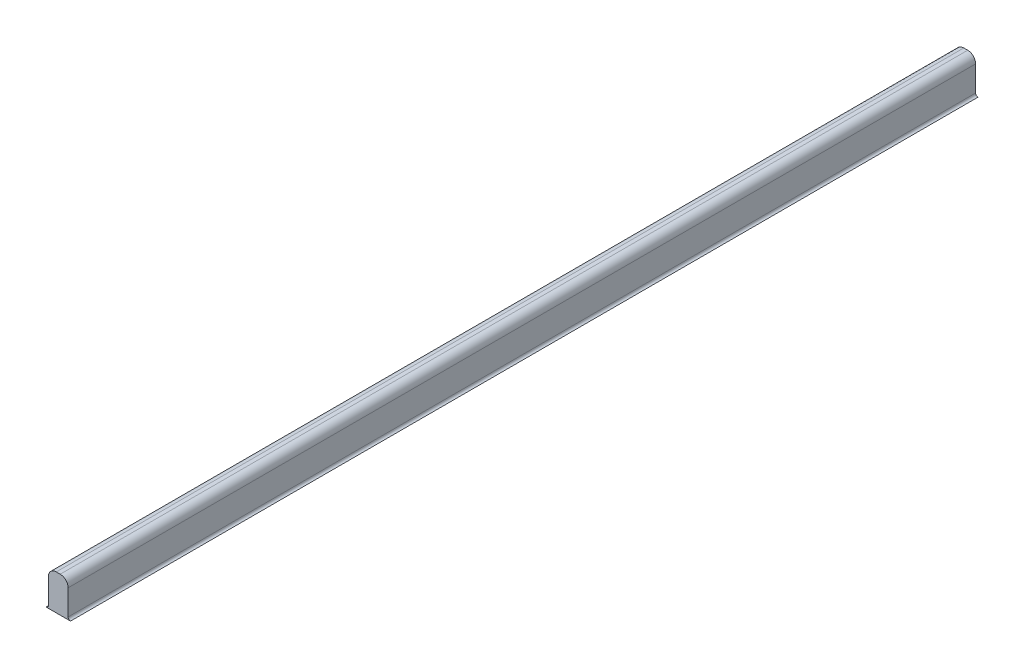
ISO-10303-21;
HEADER;
FILE_DESCRIPTION(('STEP AP214'),'2;1');
FILE_NAME('part.step','',(''),(''),'','','');
FILE_SCHEMA(('AUTOMOTIVE_DESIGN { 1 0 10303 214 1 1 1 1 }'));
ENDSEC;
DATA;
#1=APPLICATION_CONTEXT('core data for automotive mechanical design processes');
#2=APPLICATION_PROTOCOL_DEFINITION('international standard','automotive_design',2000,#1);
#3=PRODUCT_CONTEXT('',#1,'mechanical');
#4=PRODUCT('Part','Part','',(#3));
#5=PRODUCT_RELATED_PRODUCT_CATEGORY('part','',(#4));
#6=PRODUCT_DEFINITION_FORMATION('','',#4);
#7=PRODUCT_DEFINITION_CONTEXT('part definition',#1,'design');
#8=PRODUCT_DEFINITION('design','',#6,#7);
#9=PRODUCT_DEFINITION_SHAPE('','',#8);
#10=(LENGTH_UNIT() NAMED_UNIT(*) SI_UNIT(.MILLI.,.METRE.));
#11=(NAMED_UNIT(*) PLANE_ANGLE_UNIT() SI_UNIT($,.RADIAN.));
#12=(NAMED_UNIT(*) SI_UNIT($,.STERADIAN.) SOLID_ANGLE_UNIT());
#13=UNCERTAINTY_MEASURE_WITH_UNIT(LENGTH_MEASURE(1.E-05),#10,'distance_accuracy_value','');
#14=(GEOMETRIC_REPRESENTATION_CONTEXT(3) GLOBAL_UNCERTAINTY_ASSIGNED_CONTEXT((#13)) GLOBAL_UNIT_ASSIGNED_CONTEXT((#10,
#11,#12)) REPRESENTATION_CONTEXT('',''));
#15=CARTESIAN_POINT('',(0.,0.,0.));
#16=DIRECTION('',(0.,0.,1.));
#17=DIRECTION('',(1.,0.,0.));
#18=AXIS2_PLACEMENT_3D('',#15,#16,#17);
#19=CARTESIAN_POINT('',(0.,3.,115.));
#20=DIRECTION('',(0.,-1.,0.));
#21=DIRECTION('',(0.,0.,-1.));
#22=AXIS2_PLACEMENT_3D('',#19,#20,#21);
#23=PLANE('',#22);
#24=DIRECTION('',(-1.,0.,0.));
#25=VECTOR('',#24,1.);
#26=CARTESIAN_POINT('',(0.,3.,115.));
#27=LINE('',#26,#25);
#28=CARTESIAN_POINT('',(-4.,3.,115.));
#29=VERTEX_POINT('',#28);
#30=CARTESIAN_POINT('',(-4.5,3.,115.));
#31=VERTEX_POINT('',#30);
#32=EDGE_CURVE('E109',#29,#31,#27,.T.);
#33=ORIENTED_EDGE('',*,*,#32,.F.);
#34=DIRECTION('',(0.,0.,-1.));
#35=VECTOR('',#34,1.);
#36=CARTESIAN_POINT('',(-4.,3.,0.));
#37=LINE('',#36,#35);
#38=CARTESIAN_POINT('',(-4.,3.,0.));
#39=VERTEX_POINT('',#38);
#40=EDGE_CURVE('E154',#29,#39,#37,.T.);
#41=ORIENTED_EDGE('',*,*,#40,.T.);
#42=DIRECTION('',(-1.,0.,0.));
#43=VECTOR('',#42,1.);
#44=CARTESIAN_POINT('',(0.,3.,0.));
#45=LINE('',#44,#43);
#46=CARTESIAN_POINT('',(-4.5,3.,0.));
#47=VERTEX_POINT('',#46);
#48=EDGE_CURVE('E134',#39,#47,#45,.T.);
#49=ORIENTED_EDGE('',*,*,#48,.T.);
#50=DIRECTION('',(0.,0.,-1.));
#51=VECTOR('',#50,1.);
#52=CARTESIAN_POINT('',(-4.5,3.,115.));
#53=LINE('',#52,#51);
#54=EDGE_CURVE('E119',#47,#31,#53,.F.);
#55=ORIENTED_EDGE('',*,*,#54,.T.);
#56=EDGE_LOOP('',(#33,#41,#49,#55));
#57=FACE_BOUND('',#56,.T.);
#58=ADVANCED_FACE('F35',(#57),#23,.F.);
#59=CARTESIAN_POINT('',(-5.5,0.,115.));
#60=DIRECTION('',(1.,0.,0.));
#61=DIRECTION('',(0.,1.,0.));
#62=AXIS2_PLACEMENT_3D('',#59,#60,#61);
#63=PLANE('',#62);
#64=DIRECTION('',(0.,-1.,0.));
#65=VECTOR('',#64,1.);
#66=CARTESIAN_POINT('',(-5.5,0.,115.));
#67=LINE('',#66,#65);
#68=CARTESIAN_POINT('',(-5.5,2.,115.));
#69=VERTEX_POINT('',#68);
#70=CARTESIAN_POINT('',(-5.5,-1.19813267683273,115.));
#71=VERTEX_POINT('',#70);
#72=EDGE_CURVE('E100',#69,#71,#67,.T.);
#73=ORIENTED_EDGE('',*,*,#72,.F.);
#74=DIRECTION('',(0.,0.,-1.));
#75=VECTOR('',#74,1.);
#76=CARTESIAN_POINT('',(-5.5,2.,115.));
#77=LINE('',#76,#75);
#78=CARTESIAN_POINT('',(-5.5,2.,0.));
#79=VERTEX_POINT('',#78);
#80=EDGE_CURVE('E11',#69,#79,#77,.T.);
#81=ORIENTED_EDGE('',*,*,#80,.T.);
#82=DIRECTION('',(0.,-1.,0.));
#83=VECTOR('',#82,1.);
#84=CARTESIAN_POINT('',(-5.5,0.,0.));
#85=LINE('',#84,#83);
#86=CARTESIAN_POINT('',(-5.5,-1.19813267683273,0.));
#87=VERTEX_POINT('',#86);
#88=EDGE_CURVE('E115',#79,#87,#85,.T.);
#89=ORIENTED_EDGE('',*,*,#88,.T.);
#90=DIRECTION('',(0.,0.,-1.));
#91=VECTOR('',#90,1.);
#92=CARTESIAN_POINT('',(-5.5,-1.19813267683273,115.));
#93=LINE('',#92,#91);
#94=EDGE_CURVE('E112',#71,#87,#93,.T.);
#95=ORIENTED_EDGE('',*,*,#94,.F.);
#96=EDGE_LOOP('',(#73,#81,#89,#95));
#97=FACE_BOUND('',#96,.T.);
#98=ADVANCED_FACE('F113',(#97),#63,.F.);
#99=CARTESIAN_POINT('',(-5.80186732316727,-1.19813267683273,115.));
#100=DIRECTION('',(0.,0.,-1.));
#101=DIRECTION('',(-1.,0.,0.));
#102=AXIS2_PLACEMENT_3D('',#99,#100,#101);
#103=CYLINDRICAL_SURFACE('',#102,0.301867323167268);
#104=CARTESIAN_POINT('',(-5.80186732316727,-1.19813267683273,0.));
#105=DIRECTION('',(0.,0.,1.));
#106=DIRECTION('',(1.,0.,0.));
#107=AXIS2_PLACEMENT_3D('',#104,#105,#106);
#108=CIRCLE('',#107,0.301867323167268);
#109=CARTESIAN_POINT('',(-5.80186732316727,-1.5,0.));
#110=VERTEX_POINT('',#109);
#111=EDGE_CURVE('E138',#110,#87,#108,.T.);
#112=ORIENTED_EDGE('',*,*,#111,.F.);
#113=DIRECTION('',(0.,0.,-1.));
#114=VECTOR('',#113,1.);
#115=CARTESIAN_POINT('',(-5.80186732316727,-1.5,115.));
#116=LINE('',#115,#114);
#117=CARTESIAN_POINT('',(-5.80186732316727,-1.5,115.));
#118=VERTEX_POINT('',#117);
#119=EDGE_CURVE('E120',#118,#110,#116,.T.);
#120=ORIENTED_EDGE('',*,*,#119,.F.);
#121=CARTESIAN_POINT('',(-5.80186732316727,-1.19813267683273,115.));
#122=DIRECTION('',(0.,0.,1.));
#123=DIRECTION('',(1.,0.,0.));
#124=AXIS2_PLACEMENT_3D('',#121,#122,#123);
#125=CIRCLE('',#124,0.301867323167268);
#126=EDGE_CURVE('E105',#118,#71,#125,.T.);
#127=ORIENTED_EDGE('',*,*,#126,.T.);
#128=ORIENTED_EDGE('',*,*,#94,.T.);
#129=EDGE_LOOP('',(#112,#120,#127,#128));
#130=FACE_BOUND('',#129,.T.);
#131=ADVANCED_FACE('F122',(#130),#103,.F.);
#132=CARTESIAN_POINT('',(0.,-1.5,115.));
#133=DIRECTION('',(0.,-1.,0.));
#134=DIRECTION('',(0.,0.,-1.));
#135=AXIS2_PLACEMENT_3D('',#132,#133,#134);
#136=PLANE('',#135);
#137=DIRECTION('',(-1.,0.,0.));
#138=VECTOR('',#137,1.);
#139=CARTESIAN_POINT('',(0.,-1.5,0.));
#140=LINE('',#139,#138);
#141=CARTESIAN_POINT('',(-2.69813267683274,-1.5,0.));
#142=VERTEX_POINT('',#141);
#143=EDGE_CURVE('E140',#142,#110,#140,.T.);
#144=ORIENTED_EDGE('',*,*,#143,.F.);
#145=DIRECTION('',(0.,0.,-1.));
#146=VECTOR('',#145,1.);
#147=CARTESIAN_POINT('',(-2.69813267683274,-1.5,115.));
#148=LINE('',#147,#146);
#149=CARTESIAN_POINT('',(-2.69813267683274,-1.5,115.));
#150=VERTEX_POINT('',#149);
#151=EDGE_CURVE('E150',#150,#142,#148,.T.);
#152=ORIENTED_EDGE('',*,*,#151,.F.);
#153=DIRECTION('',(-1.,0.,0.));
#154=VECTOR('',#153,1.);
#155=CARTESIAN_POINT('',(0.,-1.5,115.));
#156=LINE('',#155,#154);
#157=EDGE_CURVE('E123',#150,#118,#156,.T.);
#158=ORIENTED_EDGE('',*,*,#157,.T.);
#159=ORIENTED_EDGE('',*,*,#119,.T.);
#160=EDGE_LOOP('',(#144,#152,#158,#159));
#161=FACE_BOUND('',#160,.T.);
#162=ADVANCED_FACE('F180',(#161),#136,.T.);
#163=CARTESIAN_POINT('',(-2.69813267683274,-1.19813267683273,115.));
#164=DIRECTION('',(0.,0.,-1.));
#165=DIRECTION('',(-1.,0.,0.));
#166=AXIS2_PLACEMENT_3D('',#163,#164,#165);
#167=CYLINDRICAL_SURFACE('',#166,0.301867323167267);
#168=CARTESIAN_POINT('',(-2.69813267683274,-1.19813267683273,0.));
#169=DIRECTION('',(0.,0.,1.));
#170=DIRECTION('',(1.,0.,0.));
#171=AXIS2_PLACEMENT_3D('',#168,#169,#170);
#172=CIRCLE('',#171,0.301867323167267);
#173=CARTESIAN_POINT('',(-3.,-1.19813267683273,0.));
#174=VERTEX_POINT('',#173);
#175=EDGE_CURVE('E143',#142,#174,#172,.F.);
#176=ORIENTED_EDGE('',*,*,#175,.T.);
#177=DIRECTION('',(0.,0.,-1.));
#178=VECTOR('',#177,1.);
#179=CARTESIAN_POINT('',(-3.,-1.19813267683273,115.));
#180=LINE('',#179,#178);
#181=CARTESIAN_POINT('',(-3.,-1.19813267683273,115.));
#182=VERTEX_POINT('',#181);
#183=EDGE_CURVE('E133',#182,#174,#180,.T.);
#184=ORIENTED_EDGE('',*,*,#183,.F.);
#185=CARTESIAN_POINT('',(-2.69813267683274,-1.19813267683273,115.));
#186=DIRECTION('',(0.,0.,1.));
#187=DIRECTION('',(1.,0.,0.));
#188=AXIS2_PLACEMENT_3D('',#185,#186,#187);
#189=CIRCLE('',#188,0.301867323167267);
#190=EDGE_CURVE('E125',#150,#182,#189,.F.);
#191=ORIENTED_EDGE('',*,*,#190,.F.);
#192=ORIENTED_EDGE('',*,*,#151,.T.);
#193=EDGE_LOOP('',(#176,#184,#191,#192));
#194=FACE_BOUND('',#193,.T.);
#195=ADVANCED_FACE('F177',(#194),#167,.F.);
#196=CARTESIAN_POINT('',(-3.,0.,115.));
#197=DIRECTION('',(1.,0.,0.));
#198=DIRECTION('',(0.,1.,0.));
#199=AXIS2_PLACEMENT_3D('',#196,#197,#198);
#200=PLANE('',#199);
#201=DIRECTION('',(0.,-1.,0.));
#202=VECTOR('',#201,1.);
#203=CARTESIAN_POINT('',(-3.,0.,0.));
#204=LINE('',#203,#202);
#205=CARTESIAN_POINT('',(-3.,2.,0.));
#206=VERTEX_POINT('',#205);
#207=EDGE_CURVE('E146',#206,#174,#204,.T.);
#208=ORIENTED_EDGE('',*,*,#207,.F.);
#209=DIRECTION('',(0.,0.,-1.));
#210=VECTOR('',#209,1.);
#211=CARTESIAN_POINT('',(-3.,2.,115.));
#212=LINE('',#211,#210);
#213=CARTESIAN_POINT('',(-3.,2.,115.));
#214=VERTEX_POINT('',#213);
#215=EDGE_CURVE('E58',#206,#214,#212,.F.);
#216=ORIENTED_EDGE('',*,*,#215,.T.);
#217=DIRECTION('',(0.,-1.,0.));
#218=VECTOR('',#217,1.);
#219=CARTESIAN_POINT('',(-3.,0.,115.));
#220=LINE('',#219,#218);
#221=EDGE_CURVE('E131',#214,#182,#220,.T.);
#222=ORIENTED_EDGE('',*,*,#221,.T.);
#223=ORIENTED_EDGE('',*,*,#183,.T.);
#224=EDGE_LOOP('',(#208,#216,#222,#223));
#225=FACE_BOUND('',#224,.T.);
#226=ADVANCED_FACE('F173',(#225),#200,.T.);
#227=CARTESIAN_POINT('',(0.,0.,115.));
#228=DIRECTION('',(0.,0.,1.));
#229=DIRECTION('',(1.,0.,0.));
#230=AXIS2_PLACEMENT_3D('',#227,#228,#229);
#231=PLANE('',#230);
#232=ORIENTED_EDGE('',*,*,#221,.F.);
#233=CARTESIAN_POINT('',(-4.,2.,115.));
#234=DIRECTION('',(0.,0.,1.));
#235=DIRECTION('',(1.,0.,0.));
#236=AXIS2_PLACEMENT_3D('',#233,#234,#235);
#237=CIRCLE('',#236,1.);
#238=EDGE_CURVE('E43',#214,#29,#237,.T.);
#239=ORIENTED_EDGE('',*,*,#238,.T.);
#240=ORIENTED_EDGE('',*,*,#32,.T.);
#241=CARTESIAN_POINT('',(-4.5,2.,115.));
#242=DIRECTION('',(0.,0.,1.));
#243=DIRECTION('',(1.,0.,0.));
#244=AXIS2_PLACEMENT_3D('',#241,#242,#243);
#245=CIRCLE('',#244,1.);
#246=EDGE_CURVE('E50',#31,#69,#245,.T.);
#247=ORIENTED_EDGE('',*,*,#246,.T.);
#248=ORIENTED_EDGE('',*,*,#72,.T.);
#249=ORIENTED_EDGE('',*,*,#126,.F.);
#250=ORIENTED_EDGE('',*,*,#157,.F.);
#251=ORIENTED_EDGE('',*,*,#190,.T.);
#252=EDGE_LOOP('',(#232,#239,#240,#247,#248,#249,#250,#251));
#253=FACE_BOUND('',#252,.T.);
#254=ADVANCED_FACE('F102',(#253),#231,.T.);
#255=CARTESIAN_POINT('',(0.,0.,0.));
#256=DIRECTION('',(0.,0.,1.));
#257=DIRECTION('',(1.,0.,0.));
#258=AXIS2_PLACEMENT_3D('',#255,#256,#257);
#259=PLANE('',#258);
#260=ORIENTED_EDGE('',*,*,#48,.F.);
#261=CARTESIAN_POINT('',(-4.,2.,0.));
#262=DIRECTION('',(0.,0.,1.));
#263=DIRECTION('',(1.,0.,0.));
#264=AXIS2_PLACEMENT_3D('',#261,#262,#263);
#265=CIRCLE('',#264,1.);
#266=EDGE_CURVE('E159',#39,#206,#265,.F.);
#267=ORIENTED_EDGE('',*,*,#266,.T.);
#268=ORIENTED_EDGE('',*,*,#207,.T.);
#269=ORIENTED_EDGE('',*,*,#175,.F.);
#270=ORIENTED_EDGE('',*,*,#143,.T.);
#271=ORIENTED_EDGE('',*,*,#111,.T.);
#272=ORIENTED_EDGE('',*,*,#88,.F.);
#273=CARTESIAN_POINT('',(-4.5,2.,0.));
#274=DIRECTION('',(0.,0.,1.));
#275=DIRECTION('',(1.,0.,0.));
#276=AXIS2_PLACEMENT_3D('',#273,#274,#275);
#277=CIRCLE('',#276,1.);
#278=EDGE_CURVE('E157',#79,#47,#277,.F.);
#279=ORIENTED_EDGE('',*,*,#278,.T.);
#280=EDGE_LOOP('',(#260,#267,#268,#269,#270,#271,#272,#279));
#281=FACE_BOUND('',#280,.T.);
#282=ADVANCED_FACE('F171',(#281),#259,.F.);
#283=CARTESIAN_POINT('',(-4.,2.,115.));
#284=DIRECTION('',(0.,0.,1.));
#285=DIRECTION('',(1.,0.,0.));
#286=AXIS2_PLACEMENT_3D('',#283,#284,#285);
#287=CYLINDRICAL_SURFACE('',#286,1.);
#288=ORIENTED_EDGE('',*,*,#238,.F.);
#289=ORIENTED_EDGE('',*,*,#215,.F.);
#290=ORIENTED_EDGE('',*,*,#266,.F.);
#291=ORIENTED_EDGE('',*,*,#40,.F.);
#292=EDGE_LOOP('',(#288,#289,#290,#291));
#293=FACE_BOUND('',#292,.T.);
#294=ADVANCED_FACE('F169',(#293),#287,.T.);
#295=CARTESIAN_POINT('',(-4.5,2.,115.));
#296=DIRECTION('',(0.,0.,-1.));
#297=DIRECTION('',(-1.,0.,0.));
#298=AXIS2_PLACEMENT_3D('',#295,#296,#297);
#299=CYLINDRICAL_SURFACE('',#298,1.);
#300=ORIENTED_EDGE('',*,*,#246,.F.);
#301=ORIENTED_EDGE('',*,*,#54,.F.);
#302=ORIENTED_EDGE('',*,*,#278,.F.);
#303=ORIENTED_EDGE('',*,*,#80,.F.);
#304=EDGE_LOOP('',(#300,#301,#302,#303));
#305=FACE_BOUND('',#304,.T.);
#306=ADVANCED_FACE('F37',(#305),#299,.T.);
#307=CLOSED_SHELL('',(#58,#98,#131,#162,#195,#226,#254,#282,#294,#306));
#308=MANIFOLD_SOLID_BREP('B2',#307);
#309=ADVANCED_BREP_SHAPE_REPRESENTATION('',(#18,#308),#14);
#310=SHAPE_DEFINITION_REPRESENTATION(#9,#309);
ENDSEC;
END-ISO-10303-21;
